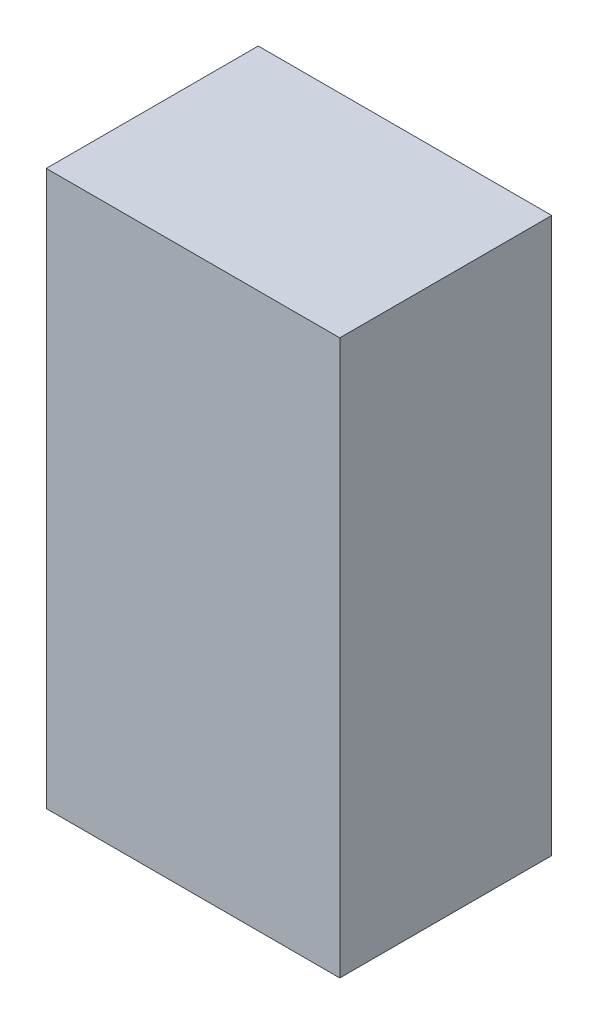
ISO-10303-21;
HEADER;
FILE_DESCRIPTION(('STEP AP214'),'2;1');
FILE_NAME('part.step','',(''),(''),'','','');
FILE_SCHEMA(('AUTOMOTIVE_DESIGN { 1 0 10303 214 1 1 1 1 }'));
ENDSEC;
DATA;
#1=APPLICATION_CONTEXT('core data for automotive mechanical design processes');
#2=APPLICATION_PROTOCOL_DEFINITION('international standard','automotive_design',2000,#1);
#3=PRODUCT_CONTEXT('',#1,'mechanical');
#4=PRODUCT('Part','Part','',(#3));
#5=PRODUCT_RELATED_PRODUCT_CATEGORY('part','',(#4));
#6=PRODUCT_DEFINITION_FORMATION('','',#4);
#7=PRODUCT_DEFINITION_CONTEXT('part definition',#1,'design');
#8=PRODUCT_DEFINITION('design','',#6,#7);
#9=PRODUCT_DEFINITION_SHAPE('','',#8);
#10=(LENGTH_UNIT() NAMED_UNIT(*) SI_UNIT(.MILLI.,.METRE.));
#11=(NAMED_UNIT(*) PLANE_ANGLE_UNIT() SI_UNIT($,.RADIAN.));
#12=(NAMED_UNIT(*) SI_UNIT($,.STERADIAN.) SOLID_ANGLE_UNIT());
#13=UNCERTAINTY_MEASURE_WITH_UNIT(LENGTH_MEASURE(1.E-05),#10,'distance_accuracy_value','');
#14=(GEOMETRIC_REPRESENTATION_CONTEXT(3) GLOBAL_UNCERTAINTY_ASSIGNED_CONTEXT((#13)) GLOBAL_UNIT_ASSIGNED_CONTEXT((#10,
#11,#12)) REPRESENTATION_CONTEXT('',''));
#15=CARTESIAN_POINT('',(0.,0.,0.));
#16=DIRECTION('',(0.,0.,1.));
#17=DIRECTION('',(1.,0.,0.));
#18=AXIS2_PLACEMENT_3D('',#15,#16,#17);
#19=CARTESIAN_POINT('',(-0.90000074,1.69999914,1.29999994));
#20=DIRECTION('',(0.,0.,-1.));
#21=DIRECTION('',(-1.,0.,0.));
#22=AXIS2_PLACEMENT_3D('',#19,#20,#21);
#23=PLANE('',#22);
#24=DIRECTION('',(1.,0.,0.));
#25=VECTOR('',#24,1.);
#26=CARTESIAN_POINT('',(-0.90000074,-1.69999914,1.29999994));
#27=LINE('',#26,#25);
#28=CARTESIAN_POINT('',(-0.90000074,-1.69999914,1.29999994));
#29=VERTEX_POINT('',#28);
#30=CARTESIAN_POINT('',(0.90000074,-1.69999914,1.29999994));
#31=VERTEX_POINT('',#30);
#32=EDGE_CURVE('E55',#29,#31,#27,.T.);
#33=ORIENTED_EDGE('',*,*,#32,.T.);
#34=DIRECTION('',(0.,1.,0.));
#35=VECTOR('',#34,1.);
#36=CARTESIAN_POINT('',(0.90000074,-1.69999914,1.29999994));
#37=LINE('',#36,#35);
#38=CARTESIAN_POINT('',(0.90000074,1.69999914,1.29999994));
#39=VERTEX_POINT('',#38);
#40=EDGE_CURVE('E57',#31,#39,#37,.T.);
#41=ORIENTED_EDGE('',*,*,#40,.T.);
#42=DIRECTION('',(1.,0.,0.));
#43=VECTOR('',#42,1.);
#44=CARTESIAN_POINT('',(0.90000074,1.69999914,1.29999994));
#45=LINE('',#44,#43);
#46=CARTESIAN_POINT('',(-0.90000074,1.69999914,1.29999994));
#47=VERTEX_POINT('',#46);
#48=EDGE_CURVE('E20',#39,#47,#45,.F.);
#49=ORIENTED_EDGE('',*,*,#48,.T.);
#50=DIRECTION('',(0.,1.,0.));
#51=VECTOR('',#50,1.);
#52=CARTESIAN_POINT('',(-0.90000074,1.69999914,1.29999994));
#53=LINE('',#52,#51);
#54=EDGE_CURVE('E80',#47,#29,#53,.F.);
#55=ORIENTED_EDGE('',*,*,#54,.T.);
#56=EDGE_LOOP('',(#33,#41,#49,#55));
#57=FACE_BOUND('',#56,.T.);
#58=ADVANCED_FACE('F17',(#57),#23,.F.);
#59=CARTESIAN_POINT('',(0.90000074,1.69999914,0.));
#60=DIRECTION('',(0.,-1.,0.));
#61=DIRECTION('',(0.,0.,-1.));
#62=AXIS2_PLACEMENT_3D('',#59,#60,#61);
#63=PLANE('',#62);
#64=DIRECTION('',(0.,0.,-1.));
#65=VECTOR('',#64,1.);
#66=CARTESIAN_POINT('',(-0.90000074,1.69999914,0.));
#67=LINE('',#66,#65);
#68=CARTESIAN_POINT('',(-0.90000074,1.69999914,0.));
#69=VERTEX_POINT('',#68);
#70=EDGE_CURVE('E68',#69,#47,#67,.F.);
#71=ORIENTED_EDGE('',*,*,#70,.T.);
#72=ORIENTED_EDGE('',*,*,#48,.F.);
#73=DIRECTION('',(0.,0.,1.));
#74=VECTOR('',#73,1.);
#75=CARTESIAN_POINT('',(0.90000074,1.69999914,0.));
#76=LINE('',#75,#74);
#77=CARTESIAN_POINT('',(0.90000074,1.69999914,0.));
#78=VERTEX_POINT('',#77);
#79=EDGE_CURVE('E63',#39,#78,#76,.F.);
#80=ORIENTED_EDGE('',*,*,#79,.T.);
#81=DIRECTION('',(-1.,0.,0.));
#82=VECTOR('',#81,1.);
#83=CARTESIAN_POINT('',(-0.90000074,1.69999914,0.));
#84=LINE('',#83,#82);
#85=EDGE_CURVE('E83',#69,#78,#84,.F.);
#86=ORIENTED_EDGE('',*,*,#85,.F.);
#87=EDGE_LOOP('',(#71,#72,#80,#86));
#88=FACE_BOUND('',#87,.T.);
#89=ADVANCED_FACE('F65',(#88),#63,.F.);
#90=CARTESIAN_POINT('',(0.90000074,-1.69999914,0.));
#91=DIRECTION('',(-1.,0.,0.));
#92=DIRECTION('',(0.,0.,1.));
#93=AXIS2_PLACEMENT_3D('',#90,#91,#92);
#94=PLANE('',#93);
#95=ORIENTED_EDGE('',*,*,#79,.F.);
#96=ORIENTED_EDGE('',*,*,#40,.F.);
#97=DIRECTION('',(0.,0.,1.));
#98=VECTOR('',#97,1.);
#99=CARTESIAN_POINT('',(0.90000074,-1.69999914,0.));
#100=LINE('',#99,#98);
#101=CARTESIAN_POINT('',(0.90000074,-1.69999914,0.));
#102=VERTEX_POINT('',#101);
#103=EDGE_CURVE('E75',#31,#102,#100,.F.);
#104=ORIENTED_EDGE('',*,*,#103,.T.);
#105=DIRECTION('',(0.,1.,0.));
#106=VECTOR('',#105,1.);
#107=CARTESIAN_POINT('',(0.90000074,1.69999914,0.));
#108=LINE('',#107,#106);
#109=EDGE_CURVE('E72',#78,#102,#108,.F.);
#110=ORIENTED_EDGE('',*,*,#109,.F.);
#111=EDGE_LOOP('',(#95,#96,#104,#110));
#112=FACE_BOUND('',#111,.T.);
#113=ADVANCED_FACE('F70',(#112),#94,.F.);
#114=CARTESIAN_POINT('',(-0.90000074,-1.69999914,0.));
#115=DIRECTION('',(0.,1.,0.));
#116=DIRECTION('',(0.,0.,1.));
#117=AXIS2_PLACEMENT_3D('',#114,#115,#116);
#118=PLANE('',#117);
#119=ORIENTED_EDGE('',*,*,#103,.F.);
#120=ORIENTED_EDGE('',*,*,#32,.F.);
#121=DIRECTION('',(0.,0.,-1.));
#122=VECTOR('',#121,1.);
#123=CARTESIAN_POINT('',(-0.90000074,-1.69999914,0.));
#124=LINE('',#123,#122);
#125=CARTESIAN_POINT('',(-0.90000074,-1.69999914,0.));
#126=VERTEX_POINT('',#125);
#127=EDGE_CURVE('E35',#29,#126,#124,.T.);
#128=ORIENTED_EDGE('',*,*,#127,.T.);
#129=DIRECTION('',(-1.,0.,0.));
#130=VECTOR('',#129,1.);
#131=CARTESIAN_POINT('',(-0.90000074,-1.69999914,0.));
#132=LINE('',#131,#130);
#133=EDGE_CURVE('E26',#102,#126,#132,.T.);
#134=ORIENTED_EDGE('',*,*,#133,.F.);
#135=EDGE_LOOP('',(#119,#120,#128,#134));
#136=FACE_BOUND('',#135,.T.);
#137=ADVANCED_FACE('F89',(#136),#118,.F.);
#138=CARTESIAN_POINT('',(-0.90000074,1.69999914,0.));
#139=DIRECTION('',(1.,0.,0.));
#140=DIRECTION('',(0.,0.,-1.));
#141=AXIS2_PLACEMENT_3D('',#138,#139,#140);
#142=PLANE('',#141);
#143=ORIENTED_EDGE('',*,*,#127,.F.);
#144=ORIENTED_EDGE('',*,*,#54,.F.);
#145=ORIENTED_EDGE('',*,*,#70,.F.);
#146=DIRECTION('',(0.,1.,0.));
#147=VECTOR('',#146,1.);
#148=CARTESIAN_POINT('',(-0.90000074,1.69999914,0.));
#149=LINE('',#148,#147);
#150=EDGE_CURVE('E11',#126,#69,#149,.T.);
#151=ORIENTED_EDGE('',*,*,#150,.F.);
#152=EDGE_LOOP('',(#143,#144,#145,#151));
#153=FACE_BOUND('',#152,.T.);
#154=ADVANCED_FACE('F91',(#153),#142,.F.);
#155=CARTESIAN_POINT('',(-0.90000074,1.69999914,0.));
#156=DIRECTION('',(0.,0.,-1.));
#157=DIRECTION('',(-1.,0.,0.));
#158=AXIS2_PLACEMENT_3D('',#155,#156,#157);
#159=PLANE('',#158);
#160=ORIENTED_EDGE('',*,*,#133,.T.);
#161=ORIENTED_EDGE('',*,*,#150,.T.);
#162=ORIENTED_EDGE('',*,*,#85,.T.);
#163=ORIENTED_EDGE('',*,*,#109,.T.);
#164=EDGE_LOOP('',(#160,#161,#162,#163));
#165=FACE_BOUND('',#164,.T.);
#166=ADVANCED_FACE('F88',(#165),#159,.T.);
#167=CLOSED_SHELL('',(#58,#89,#113,#137,#154,#166));
#168=MANIFOLD_SOLID_BREP('B1',#167);
#169=ADVANCED_BREP_SHAPE_REPRESENTATION('',(#18,#168),#14);
#170=SHAPE_DEFINITION_REPRESENTATION(#9,#169);
ENDSEC;
END-ISO-10303-21;
